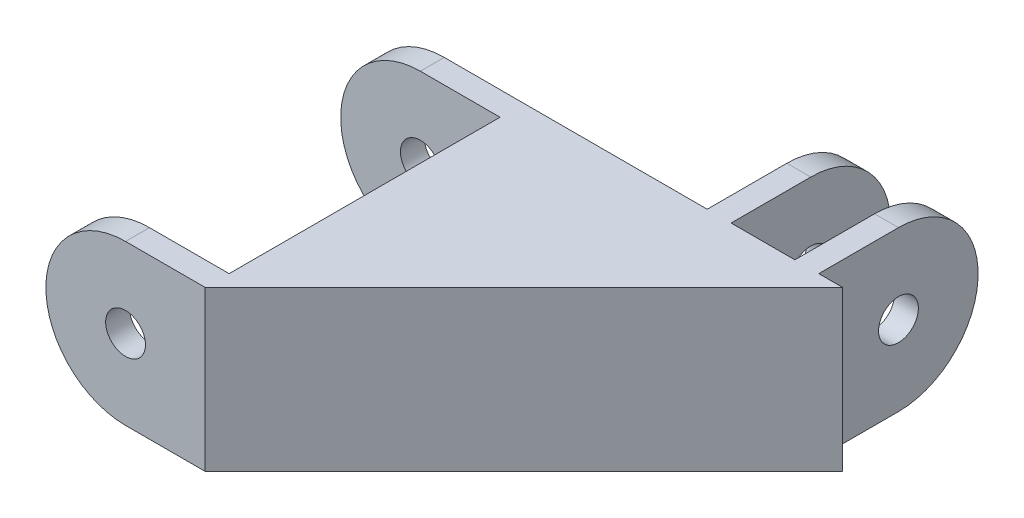
ISO-10303-21;
HEADER;
FILE_DESCRIPTION(('STEP AP214'),'2;1');
FILE_NAME('part.step','',(''),(''),'','','');
FILE_SCHEMA(('AUTOMOTIVE_DESIGN { 1 0 10303 214 1 1 1 1 }'));
ENDSEC;
DATA;
#1=APPLICATION_CONTEXT('core data for automotive mechanical design processes');
#2=APPLICATION_PROTOCOL_DEFINITION('international standard','automotive_design',2000,#1);
#3=PRODUCT_CONTEXT('',#1,'mechanical');
#4=PRODUCT('Part','Part','',(#3));
#5=PRODUCT_RELATED_PRODUCT_CATEGORY('part','',(#4));
#6=PRODUCT_DEFINITION_FORMATION('','',#4);
#7=PRODUCT_DEFINITION_CONTEXT('part definition',#1,'design');
#8=PRODUCT_DEFINITION('design','',#6,#7);
#9=PRODUCT_DEFINITION_SHAPE('','',#8);
#10=(LENGTH_UNIT() NAMED_UNIT(*) SI_UNIT(.MILLI.,.METRE.));
#11=(NAMED_UNIT(*) PLANE_ANGLE_UNIT() SI_UNIT($,.RADIAN.));
#12=(NAMED_UNIT(*) SI_UNIT($,.STERADIAN.) SOLID_ANGLE_UNIT());
#13=UNCERTAINTY_MEASURE_WITH_UNIT(LENGTH_MEASURE(1.E-05),#10,'distance_accuracy_value','');
#14=(GEOMETRIC_REPRESENTATION_CONTEXT(3) GLOBAL_UNCERTAINTY_ASSIGNED_CONTEXT((#13)) GLOBAL_UNIT_ASSIGNED_CONTEXT((#10,
#11,#12)) REPRESENTATION_CONTEXT('',''));
#15=CARTESIAN_POINT('',(0.,0.,0.));
#16=DIRECTION('',(0.,0.,1.));
#17=DIRECTION('',(1.,0.,0.));
#18=AXIS2_PLACEMENT_3D('',#15,#16,#17);
#19=CARTESIAN_POINT('',(0.,10.,-40.));
#20=DIRECTION('',(0.,0.,1.));
#21=DIRECTION('',(1.,0.,0.));
#22=AXIS2_PLACEMENT_3D('',#19,#20,#21);
#23=PLANE('',#22);
#24=DIRECTION('',(-1.,0.,0.));
#25=VECTOR('',#24,1.);
#26=CARTESIAN_POINT('',(0.,-8.,-40.));
#27=LINE('',#26,#25);
#28=CARTESIAN_POINT('',(34.,-8.,-40.));
#29=VERTEX_POINT('',#28);
#30=CARTESIAN_POINT('',(26.,-8.,-40.));
#31=VERTEX_POINT('',#30);
#32=EDGE_CURVE('E44',#29,#31,#27,.T.);
#33=ORIENTED_EDGE('',*,*,#32,.F.);
#34=DIRECTION('',(0.,-1.,0.));
#35=VECTOR('',#34,1.);
#36=CARTESIAN_POINT('',(34.,10.,-40.));
#37=LINE('',#36,#35);
#38=CARTESIAN_POINT('',(34.,-10.,-40.));
#39=VERTEX_POINT('',#38);
#40=EDGE_CURVE('E38',#29,#39,#37,.T.);
#41=ORIENTED_EDGE('',*,*,#40,.T.);
#42=DIRECTION('',(-1.,0.,0.));
#43=VECTOR('',#42,1.);
#44=CARTESIAN_POINT('',(0.,-10.,-40.));
#45=LINE('',#44,#43);
#46=CARTESIAN_POINT('',(26.,-10.,-40.));
#47=VERTEX_POINT('',#46);
#48=EDGE_CURVE('E393',#39,#47,#45,.T.);
#49=ORIENTED_EDGE('',*,*,#48,.T.);
#50=DIRECTION('',(0.,-1.,0.));
#51=VECTOR('',#50,1.);
#52=CARTESIAN_POINT('',(26.,10.,-40.));
#53=LINE('',#52,#51);
#54=EDGE_CURVE('E456',#31,#47,#53,.T.);
#55=ORIENTED_EDGE('',*,*,#54,.F.);
#56=EDGE_LOOP('',(#33,#41,#49,#55));
#57=FACE_BOUND('',#56,.T.);
#58=ADVANCED_FACE('F34',(#57),#23,.F.);
#59=CARTESIAN_POINT('',(0.,10.,0.));
#60=DIRECTION('',(1.,0.,0.));
#61=DIRECTION('',(0.,0.,-1.));
#62=AXIS2_PLACEMENT_3D('',#59,#60,#61);
#63=PLANE('',#62);
#64=DIRECTION('',(0.,0.,1.));
#65=VECTOR('',#64,1.);
#66=CARTESIAN_POINT('',(0.,-8.,0.));
#67=LINE('',#66,#65);
#68=CARTESIAN_POINT('',(0.,-8.,-37.));
#69=VERTEX_POINT('',#68);
#70=CARTESIAN_POINT('',(0.,-8.,-3.));
#71=VERTEX_POINT('',#70);
#72=EDGE_CURVE('E276',#69,#71,#67,.T.);
#73=ORIENTED_EDGE('',*,*,#72,.F.);
#74=DIRECTION('',(0.,1.,0.));
#75=VECTOR('',#74,1.);
#76=CARTESIAN_POINT('',(0.,10.,-37.));
#77=LINE('',#76,#75);
#78=CARTESIAN_POINT('',(0.,-10.,-37.));
#79=VERTEX_POINT('',#78);
#80=EDGE_CURVE('E296',#79,#69,#77,.T.);
#81=ORIENTED_EDGE('',*,*,#80,.F.);
#82=DIRECTION('',(0.,0.,1.));
#83=VECTOR('',#82,1.);
#84=CARTESIAN_POINT('',(0.,-10.,0.));
#85=LINE('',#84,#83);
#86=CARTESIAN_POINT('',(0.,-10.,-3.));
#87=VERTEX_POINT('',#86);
#88=EDGE_CURVE('E383',#79,#87,#85,.T.);
#89=ORIENTED_EDGE('',*,*,#88,.T.);
#90=DIRECTION('',(0.,1.,0.));
#91=VECTOR('',#90,1.);
#92=CARTESIAN_POINT('',(0.,10.,-3.));
#93=LINE('',#92,#91);
#94=EDGE_CURVE('E325',#87,#71,#93,.T.);
#95=ORIENTED_EDGE('',*,*,#94,.T.);
#96=EDGE_LOOP('',(#73,#81,#89,#95));
#97=FACE_BOUND('',#96,.T.);
#98=ADVANCED_FACE('F540',(#97),#63,.F.);
#99=CARTESIAN_POINT('',(34.,0.,-50.));
#100=DIRECTION('',(1.,0.,0.));
#101=DIRECTION('',(0.,0.,-1.));
#102=AXIS2_PLACEMENT_3D('',#99,#100,#101);
#103=PLANE('',#102);
#104=DIRECTION('',(0.,0.,-1.));
#105=VECTOR('',#104,1.);
#106=CARTESIAN_POINT('',(34.,-10.,-40.));
#107=LINE('',#106,#105);
#108=CARTESIAN_POINT('',(34.,-10.,-50.));
#109=VERTEX_POINT('',#108);
#110=EDGE_CURVE('E356',#39,#109,#107,.T.);
#111=ORIENTED_EDGE('',*,*,#110,.F.);
#112=ORIENTED_EDGE('',*,*,#40,.F.);
#113=CARTESIAN_POINT('',(34.,8.,-40.));
#114=VERTEX_POINT('',#113);
#115=EDGE_CURVE('E337',#114,#29,#37,.T.);
#116=ORIENTED_EDGE('',*,*,#115,.F.);
#117=CARTESIAN_POINT('',(34.,10.,-40.));
#118=VERTEX_POINT('',#117);
#119=EDGE_CURVE('E338',#118,#114,#37,.T.);
#120=ORIENTED_EDGE('',*,*,#119,.F.);
#121=DIRECTION('',(0.,0.,1.));
#122=VECTOR('',#121,1.);
#123=CARTESIAN_POINT('',(34.,10.,-40.));
#124=LINE('',#123,#122);
#125=CARTESIAN_POINT('',(34.,10.,-50.));
#126=VERTEX_POINT('',#125);
#127=EDGE_CURVE('E362',#126,#118,#124,.T.);
#128=ORIENTED_EDGE('',*,*,#127,.F.);
#129=CARTESIAN_POINT('',(34.,0.,-50.));
#130=DIRECTION('',(1.,0.,0.));
#131=DIRECTION('',(0.,0.,-1.));
#132=AXIS2_PLACEMENT_3D('',#129,#130,#131);
#133=CIRCLE('',#132,10.);
#134=EDGE_CURVE('E342',#109,#126,#133,.T.);
#135=ORIENTED_EDGE('',*,*,#134,.F.);
#136=EDGE_LOOP('',(#111,#112,#116,#120,#128,#135));
#137=FACE_BOUND('',#136,.T.);
#138=CARTESIAN_POINT('',(34.,0.,-50.));
#139=DIRECTION('',(1.,0.,0.));
#140=DIRECTION('',(0.,0.,-1.));
#141=AXIS2_PLACEMENT_3D('',#138,#139,#140);
#142=CIRCLE('',#141,2.5);
#143=CARTESIAN_POINT('',(34.,0.,-52.5));
#144=VERTEX_POINT('',#143);
#145=EDGE_CURVE('E430',#144,#144,#142,.F.);
#146=ORIENTED_EDGE('',*,*,#145,.F.);
#147=EDGE_LOOP('',(#146));
#148=FACE_BOUND('',#147,.T.);
#149=ADVANCED_FACE('F483',(#137,#148),#103,.F.);
#150=CARTESIAN_POINT('',(37.,0.,-50.));
#151=DIRECTION('',(1.,0.,0.));
#152=DIRECTION('',(0.,0.,-1.));
#153=AXIS2_PLACEMENT_3D('',#150,#151,#152);
#154=PLANE('',#153);
#155=DIRECTION('',(0.,0.,-1.));
#156=VECTOR('',#155,1.);
#157=CARTESIAN_POINT('',(37.,-10.,-40.));
#158=LINE('',#157,#156);
#159=CARTESIAN_POINT('',(37.,-10.,-40.));
#160=VERTEX_POINT('',#159);
#161=CARTESIAN_POINT('',(37.,-10.,-50.));
#162=VERTEX_POINT('',#161);
#163=EDGE_CURVE('E372',#160,#162,#158,.T.);
#164=ORIENTED_EDGE('',*,*,#163,.T.);
#165=CARTESIAN_POINT('',(37.,0.,-50.));
#166=DIRECTION('',(1.,0.,0.));
#167=DIRECTION('',(0.,0.,-1.));
#168=AXIS2_PLACEMENT_3D('',#165,#166,#167);
#169=CIRCLE('',#168,10.);
#170=CARTESIAN_POINT('',(37.,10.,-50.));
#171=VERTEX_POINT('',#170);
#172=EDGE_CURVE('E344',#162,#171,#169,.T.);
#173=ORIENTED_EDGE('',*,*,#172,.T.);
#174=DIRECTION('',(0.,0.,1.));
#175=VECTOR('',#174,1.);
#176=CARTESIAN_POINT('',(37.,10.,-40.));
#177=LINE('',#176,#175);
#178=CARTESIAN_POINT('',(37.,10.,-40.));
#179=VERTEX_POINT('',#178);
#180=EDGE_CURVE('E366',#171,#179,#177,.T.);
#181=ORIENTED_EDGE('',*,*,#180,.T.);
#182=DIRECTION('',(0.,-1.,0.));
#183=VECTOR('',#182,1.);
#184=CARTESIAN_POINT('',(37.,10.,-40.));
#185=LINE('',#184,#183);
#186=EDGE_CURVE('E359',#179,#160,#185,.T.);
#187=ORIENTED_EDGE('',*,*,#186,.T.);
#188=EDGE_LOOP('',(#164,#173,#181,#187));
#189=FACE_BOUND('',#188,.T.);
#190=CARTESIAN_POINT('',(37.,0.,-50.));
#191=DIRECTION('',(1.,0.,0.));
#192=DIRECTION('',(0.,0.,-1.));
#193=AXIS2_PLACEMENT_3D('',#190,#191,#192);
#194=CIRCLE('',#193,2.5);
#195=CARTESIAN_POINT('',(37.,0.,-52.5));
#196=VERTEX_POINT('',#195);
#197=EDGE_CURVE('E415',#196,#196,#194,.F.);
#198=ORIENTED_EDGE('',*,*,#197,.T.);
#199=EDGE_LOOP('',(#198));
#200=FACE_BOUND('',#199,.T.);
#201=ADVANCED_FACE('F495',(#189,#200),#154,.T.);
#202=CARTESIAN_POINT('',(23.,0.,-50.));
#203=DIRECTION('',(1.,0.,0.));
#204=DIRECTION('',(0.,0.,-1.));
#205=AXIS2_PLACEMENT_3D('',#202,#203,#204);
#206=PLANE('',#205);
#207=DIRECTION('',(0.,0.,-1.));
#208=VECTOR('',#207,1.);
#209=CARTESIAN_POINT('',(23.,-10.,-40.));
#210=LINE('',#209,#208);
#211=CARTESIAN_POINT('',(23.,-10.,-40.));
#212=VERTEX_POINT('',#211);
#213=CARTESIAN_POINT('',(23.,-10.,-50.));
#214=VERTEX_POINT('',#213);
#215=EDGE_CURVE('E434',#212,#214,#210,.T.);
#216=ORIENTED_EDGE('',*,*,#215,.F.);
#217=DIRECTION('',(0.,-1.,0.));
#218=VECTOR('',#217,1.);
#219=CARTESIAN_POINT('',(23.,10.,-40.));
#220=LINE('',#219,#218);
#221=CARTESIAN_POINT('',(23.,10.,-40.));
#222=VERTEX_POINT('',#221);
#223=EDGE_CURVE('E444',#222,#212,#220,.T.);
#224=ORIENTED_EDGE('',*,*,#223,.F.);
#225=DIRECTION('',(0.,0.,1.));
#226=VECTOR('',#225,1.);
#227=CARTESIAN_POINT('',(23.,10.,-40.));
#228=LINE('',#227,#226);
#229=CARTESIAN_POINT('',(23.,10.,-50.));
#230=VERTEX_POINT('',#229);
#231=EDGE_CURVE('E441',#230,#222,#228,.T.);
#232=ORIENTED_EDGE('',*,*,#231,.F.);
#233=CARTESIAN_POINT('',(23.,0.,-50.));
#234=DIRECTION('',(1.,0.,0.));
#235=DIRECTION('',(0.,0.,-1.));
#236=AXIS2_PLACEMENT_3D('',#233,#234,#235);
#237=CIRCLE('',#236,10.);
#238=EDGE_CURVE('E437',#214,#230,#237,.T.);
#239=ORIENTED_EDGE('',*,*,#238,.F.);
#240=EDGE_LOOP('',(#216,#224,#232,#239));
#241=FACE_BOUND('',#240,.T.);
#242=CARTESIAN_POINT('',(23.,0.,-50.));
#243=DIRECTION('',(1.,0.,0.));
#244=DIRECTION('',(0.,0.,-1.));
#245=AXIS2_PLACEMENT_3D('',#242,#243,#244);
#246=CIRCLE('',#245,2.5);
#247=CARTESIAN_POINT('',(23.,0.,-52.5));
#248=VERTEX_POINT('',#247);
#249=EDGE_CURVE('E410',#248,#248,#246,.F.);
#250=ORIENTED_EDGE('',*,*,#249,.F.);
#251=EDGE_LOOP('',(#250));
#252=FACE_BOUND('',#251,.T.);
#253=ADVANCED_FACE('F696',(#241,#252),#206,.F.);
#254=CARTESIAN_POINT('',(26.,0.,-50.));
#255=DIRECTION('',(1.,0.,0.));
#256=DIRECTION('',(0.,0.,-1.));
#257=AXIS2_PLACEMENT_3D('',#254,#255,#256);
#258=PLANE('',#257);
#259=DIRECTION('',(0.,0.,-1.));
#260=VECTOR('',#259,1.);
#261=CARTESIAN_POINT('',(26.,-10.,-40.));
#262=LINE('',#261,#260);
#263=CARTESIAN_POINT('',(26.,-10.,-50.));
#264=VERTEX_POINT('',#263);
#265=EDGE_CURVE('E433',#47,#264,#262,.T.);
#266=ORIENTED_EDGE('',*,*,#265,.T.);
#267=CARTESIAN_POINT('',(26.,0.,-50.));
#268=DIRECTION('',(1.,0.,0.));
#269=DIRECTION('',(0.,0.,-1.));
#270=AXIS2_PLACEMENT_3D('',#267,#268,#269);
#271=CIRCLE('',#270,10.);
#272=CARTESIAN_POINT('',(26.,10.,-50.));
#273=VERTEX_POINT('',#272);
#274=EDGE_CURVE('E450',#264,#273,#271,.T.);
#275=ORIENTED_EDGE('',*,*,#274,.T.);
#276=DIRECTION('',(0.,0.,1.));
#277=VECTOR('',#276,1.);
#278=CARTESIAN_POINT('',(26.,10.,-40.));
#279=LINE('',#278,#277);
#280=CARTESIAN_POINT('',(26.,10.,-40.));
#281=VERTEX_POINT('',#280);
#282=EDGE_CURVE('E453',#273,#281,#279,.T.);
#283=ORIENTED_EDGE('',*,*,#282,.T.);
#284=CARTESIAN_POINT('',(26.,8.,-40.));
#285=VERTEX_POINT('',#284);
#286=EDGE_CURVE('E438',#281,#285,#53,.T.);
#287=ORIENTED_EDGE('',*,*,#286,.T.);
#288=EDGE_CURVE('E459',#285,#31,#53,.T.);
#289=ORIENTED_EDGE('',*,*,#288,.T.);
#290=ORIENTED_EDGE('',*,*,#54,.T.);
#291=EDGE_LOOP('',(#266,#275,#283,#287,#289,#290));
#292=FACE_BOUND('',#291,.T.);
#293=CARTESIAN_POINT('',(26.,0.,-50.));
#294=DIRECTION('',(1.,0.,0.));
#295=DIRECTION('',(0.,0.,-1.));
#296=AXIS2_PLACEMENT_3D('',#293,#294,#295);
#297=CIRCLE('',#296,2.5);
#298=CARTESIAN_POINT('',(26.,0.,-52.5));
#299=VERTEX_POINT('',#298);
#300=EDGE_CURVE('E408',#299,#299,#297,.F.);
#301=ORIENTED_EDGE('',*,*,#300,.T.);
#302=EDGE_LOOP('',(#301));
#303=FACE_BOUND('',#302,.T.);
#304=ADVANCED_FACE('F473',(#292,#303),#258,.T.);
#305=ORIENTED_EDGE('',*,*,#223,.T.);
#306=CARTESIAN_POINT('',(-10.,-10.,-40.));
#307=VERTEX_POINT('',#306);
#308=EDGE_CURVE('E398',#212,#307,#45,.T.);
#309=ORIENTED_EDGE('',*,*,#308,.T.);
#310=CARTESIAN_POINT('',(-10.,0.,-40.));
#311=DIRECTION('',(0.,0.,1.));
#312=DIRECTION('',(1.,0.,0.));
#313=AXIS2_PLACEMENT_3D('',#310,#311,#312);
#314=CIRCLE('',#313,10.);
#315=CARTESIAN_POINT('',(-10.,10.,-40.));
#316=VERTEX_POINT('',#315);
#317=EDGE_CURVE('E291',#316,#307,#314,.T.);
#318=ORIENTED_EDGE('',*,*,#317,.F.);
#319=DIRECTION('',(-1.,0.,0.));
#320=VECTOR('',#319,1.);
#321=CARTESIAN_POINT('',(0.,10.,-40.));
#322=LINE('',#321,#320);
#323=EDGE_CURVE('E382',#222,#316,#322,.T.);
#324=ORIENTED_EDGE('',*,*,#323,.F.);
#325=EDGE_LOOP('',(#305,#309,#318,#324));
#326=FACE_BOUND('',#325,.T.);
#327=CARTESIAN_POINT('',(-10.,0.,-40.));
#328=DIRECTION('',(0.,0.,1.));
#329=DIRECTION('',(1.,0.,0.));
#330=AXIS2_PLACEMENT_3D('',#327,#328,#329);
#331=CIRCLE('',#330,2.5);
#332=CARTESIAN_POINT('',(-7.5,0.,-40.));
#333=VERTEX_POINT('',#332);
#334=EDGE_CURVE('E285',#333,#333,#331,.T.);
#335=ORIENTED_EDGE('',*,*,#334,.T.);
#336=EDGE_LOOP('',(#335));
#337=FACE_BOUND('',#336,.T.);
#338=ADVANCED_FACE('F561',(#326,#337),#23,.F.);
#339=ORIENTED_EDGE('',*,*,#186,.F.);
#340=CARTESIAN_POINT('',(40.,10.,-40.));
#341=VERTEX_POINT('',#340);
#342=EDGE_CURVE('E390',#341,#179,#322,.T.);
#343=ORIENTED_EDGE('',*,*,#342,.F.);
#344=DIRECTION('',(0.,-1.,0.));
#345=VECTOR('',#344,1.);
#346=CARTESIAN_POINT('',(40.,10.,-40.));
#347=LINE('',#346,#345);
#348=CARTESIAN_POINT('',(40.,-10.,-40.));
#349=VERTEX_POINT('',#348);
#350=EDGE_CURVE('E504',#341,#349,#347,.T.);
#351=ORIENTED_EDGE('',*,*,#350,.T.);
#352=EDGE_CURVE('E397',#349,#160,#45,.T.);
#353=ORIENTED_EDGE('',*,*,#352,.T.);
#354=EDGE_LOOP('',(#339,#343,#351,#353));
#355=FACE_BOUND('',#354,.T.);
#356=ADVANCED_FACE('F505',(#355),#23,.F.);
#357=CARTESIAN_POINT('',(40.,10.,-40.));
#358=DIRECTION('',(-0.707106781186548,0.,-0.707106781186548));
#359=DIRECTION('',(-0.707106781186548,0.,0.707106781186548));
#360=AXIS2_PLACEMENT_3D('',#357,#358,#359);
#361=PLANE('',#360);
#362=DIRECTION('',(0.707106781186548,0.,-0.707106781186548));
#363=VECTOR('',#362,1.);
#364=CARTESIAN_POINT('',(40.,-10.,-40.));
#365=LINE('',#364,#363);
#366=CARTESIAN_POINT('',(0.,-10.,0.));
#367=VERTEX_POINT('',#366);
#368=EDGE_CURVE('E378',#367,#349,#365,.T.);
#369=ORIENTED_EDGE('',*,*,#368,.T.);
#370=ORIENTED_EDGE('',*,*,#350,.F.);
#371=DIRECTION('',(0.707106781186548,0.,-0.707106781186548));
#372=VECTOR('',#371,1.);
#373=CARTESIAN_POINT('',(40.,10.,-40.));
#374=LINE('',#373,#372);
#375=CARTESIAN_POINT('',(0.,10.,0.));
#376=VERTEX_POINT('',#375);
#377=EDGE_CURVE('E380',#376,#341,#374,.T.);
#378=ORIENTED_EDGE('',*,*,#377,.F.);
#379=DIRECTION('',(0.,-1.,0.));
#380=VECTOR('',#379,1.);
#381=CARTESIAN_POINT('',(0.,10.,0.));
#382=LINE('',#381,#380);
#383=EDGE_CURVE('E508',#376,#367,#382,.T.);
#384=ORIENTED_EDGE('',*,*,#383,.T.);
#385=EDGE_LOOP('',(#369,#370,#378,#384));
#386=FACE_BOUND('',#385,.T.);
#387=ADVANCED_FACE('F36',(#386),#361,.F.);
#388=ORIENTED_EDGE('',*,*,#119,.T.);
#389=DIRECTION('',(-1.,0.,0.));
#390=VECTOR('',#389,1.);
#391=CARTESIAN_POINT('',(0.,8.,-40.));
#392=LINE('',#391,#390);
#393=EDGE_CURVE('E11',#114,#285,#392,.T.);
#394=ORIENTED_EDGE('',*,*,#393,.T.);
#395=ORIENTED_EDGE('',*,*,#286,.F.);
#396=EDGE_CURVE('E353',#118,#281,#322,.T.);
#397=ORIENTED_EDGE('',*,*,#396,.F.);
#398=EDGE_LOOP('',(#388,#394,#395,#397));
#399=FACE_BOUND('',#398,.T.);
#400=ADVANCED_FACE('F562',(#399),#23,.F.);
#401=CARTESIAN_POINT('',(0.,8.,-37.));
#402=VERTEX_POINT('',#401);
#403=CARTESIAN_POINT('',(0.,10.,-37.));
#404=VERTEX_POINT('',#403);
#405=EDGE_CURVE('E288',#402,#404,#77,.T.);
#406=ORIENTED_EDGE('',*,*,#405,.F.);
#407=DIRECTION('',(0.,0.,1.));
#408=VECTOR('',#407,1.);
#409=CARTESIAN_POINT('',(0.,8.,0.));
#410=LINE('',#409,#408);
#411=CARTESIAN_POINT('',(0.,8.,-3.));
#412=VERTEX_POINT('',#411);
#413=EDGE_CURVE('E252',#402,#412,#410,.T.);
#414=ORIENTED_EDGE('',*,*,#413,.T.);
#415=CARTESIAN_POINT('',(0.,10.,-3.));
#416=VERTEX_POINT('',#415);
#417=EDGE_CURVE('E332',#412,#416,#93,.T.);
#418=ORIENTED_EDGE('',*,*,#417,.T.);
#419=DIRECTION('',(0.,0.,1.));
#420=VECTOR('',#419,1.);
#421=CARTESIAN_POINT('',(0.,10.,0.));
#422=LINE('',#421,#420);
#423=EDGE_CURVE('E333',#404,#416,#422,.T.);
#424=ORIENTED_EDGE('',*,*,#423,.F.);
#425=EDGE_LOOP('',(#406,#414,#418,#424));
#426=FACE_BOUND('',#425,.T.);
#427=ADVANCED_FACE('F567',(#426),#63,.F.);
#428=CARTESIAN_POINT('',(0.,10.,0.));
#429=DIRECTION('',(0.,-1.,0.));
#430=DIRECTION('',(0.,0.,-1.));
#431=AXIS2_PLACEMENT_3D('',#428,#429,#430);
#432=PLANE('',#431);
#433=ORIENTED_EDGE('',*,*,#377,.T.);
#434=ORIENTED_EDGE('',*,*,#342,.T.);
#435=ORIENTED_EDGE('',*,*,#180,.F.);
#436=DIRECTION('',(1.,0.,0.));
#437=VECTOR('',#436,1.);
#438=CARTESIAN_POINT('',(34.,10.,-50.));
#439=LINE('',#438,#437);
#440=EDGE_CURVE('E376',#126,#171,#439,.T.);
#441=ORIENTED_EDGE('',*,*,#440,.F.);
#442=ORIENTED_EDGE('',*,*,#127,.T.);
#443=ORIENTED_EDGE('',*,*,#396,.T.);
#444=ORIENTED_EDGE('',*,*,#282,.F.);
#445=DIRECTION('',(1.,0.,0.));
#446=VECTOR('',#445,1.);
#447=CARTESIAN_POINT('',(23.,10.,-50.));
#448=LINE('',#447,#446);
#449=EDGE_CURVE('E460',#230,#273,#448,.T.);
#450=ORIENTED_EDGE('',*,*,#449,.F.);
#451=ORIENTED_EDGE('',*,*,#231,.T.);
#452=ORIENTED_EDGE('',*,*,#323,.T.);
#453=DIRECTION('',(0.,0.,1.));
#454=VECTOR('',#453,1.);
#455=CARTESIAN_POINT('',(-10.,10.,-40.));
#456=LINE('',#455,#454);
#457=CARTESIAN_POINT('',(-10.,10.,-37.));
#458=VERTEX_POINT('',#457);
#459=EDGE_CURVE('E294',#316,#458,#456,.T.);
#460=ORIENTED_EDGE('',*,*,#459,.T.);
#461=DIRECTION('',(-1.,0.,0.));
#462=VECTOR('',#461,1.);
#463=CARTESIAN_POINT('',(0.,10.,-37.));
#464=LINE('',#463,#462);
#465=EDGE_CURVE('E299',#404,#458,#464,.T.);
#466=ORIENTED_EDGE('',*,*,#465,.F.);
#467=ORIENTED_EDGE('',*,*,#423,.T.);
#468=DIRECTION('',(-1.,0.,0.));
#469=VECTOR('',#468,1.);
#470=CARTESIAN_POINT('',(0.,10.,-3.));
#471=LINE('',#470,#469);
#472=CARTESIAN_POINT('',(-10.,10.,-3.));
#473=VERTEX_POINT('',#472);
#474=EDGE_CURVE('E520',#416,#473,#471,.T.);
#475=ORIENTED_EDGE('',*,*,#474,.T.);
#476=DIRECTION('',(0.,0.,1.));
#477=VECTOR('',#476,1.);
#478=CARTESIAN_POINT('',(-10.,10.,-3.));
#479=LINE('',#478,#477);
#480=CARTESIAN_POINT('',(-10.,10.,0.));
#481=VERTEX_POINT('',#480);
#482=EDGE_CURVE('E417',#473,#481,#479,.T.);
#483=ORIENTED_EDGE('',*,*,#482,.T.);
#484=DIRECTION('',(-1.,0.,0.));
#485=VECTOR('',#484,1.);
#486=CARTESIAN_POINT('',(0.,10.,0.));
#487=LINE('',#486,#485);
#488=EDGE_CURVE('E315',#376,#481,#487,.T.);
#489=ORIENTED_EDGE('',*,*,#488,.F.);
#490=EDGE_LOOP('',(#433,#434,#435,#441,#442,#443,#444,#450,#451,#452,#460,#466,#467,#475,#483,#489));
#491=FACE_BOUND('',#490,.T.);
#492=ADVANCED_FACE('F519',(#491),#432,.F.);
#493=CARTESIAN_POINT('',(0.,-10.,0.));
#494=DIRECTION('',(0.,-1.,0.));
#495=DIRECTION('',(0.,0.,-1.));
#496=AXIS2_PLACEMENT_3D('',#493,#494,#495);
#497=PLANE('',#496);
#498=ORIENTED_EDGE('',*,*,#368,.F.);
#499=DIRECTION('',(1.,0.,0.));
#500=VECTOR('',#499,1.);
#501=CARTESIAN_POINT('',(0.,-10.,0.));
#502=LINE('',#501,#500);
#503=CARTESIAN_POINT('',(-10.,-10.,0.));
#504=VERTEX_POINT('',#503);
#505=EDGE_CURVE('E336',#504,#367,#502,.T.);
#506=ORIENTED_EDGE('',*,*,#505,.F.);
#507=DIRECTION('',(0.,0.,1.));
#508=VECTOR('',#507,1.);
#509=CARTESIAN_POINT('',(-10.,-10.,-3.));
#510=LINE('',#509,#508);
#511=CARTESIAN_POINT('',(-10.,-10.,-3.));
#512=VERTEX_POINT('',#511);
#513=EDGE_CURVE('E411',#512,#504,#510,.T.);
#514=ORIENTED_EDGE('',*,*,#513,.F.);
#515=DIRECTION('',(1.,0.,0.));
#516=VECTOR('',#515,1.);
#517=CARTESIAN_POINT('',(0.,-10.,-3.));
#518=LINE('',#517,#516);
#519=EDGE_CURVE('E423',#512,#87,#518,.T.);
#520=ORIENTED_EDGE('',*,*,#519,.T.);
#521=ORIENTED_EDGE('',*,*,#88,.F.);
#522=DIRECTION('',(1.,0.,0.));
#523=VECTOR('',#522,1.);
#524=CARTESIAN_POINT('',(0.,-10.,-37.));
#525=LINE('',#524,#523);
#526=CARTESIAN_POINT('',(-10.,-10.,-37.));
#527=VERTEX_POINT('',#526);
#528=EDGE_CURVE('E295',#527,#79,#525,.T.);
#529=ORIENTED_EDGE('',*,*,#528,.F.);
#530=DIRECTION('',(0.,0.,1.));
#531=VECTOR('',#530,1.);
#532=CARTESIAN_POINT('',(-10.,-10.,-40.));
#533=LINE('',#532,#531);
#534=EDGE_CURVE('E308',#307,#527,#533,.T.);
#535=ORIENTED_EDGE('',*,*,#534,.F.);
#536=ORIENTED_EDGE('',*,*,#308,.F.);
#537=ORIENTED_EDGE('',*,*,#215,.T.);
#538=DIRECTION('',(1.,0.,0.));
#539=VECTOR('',#538,1.);
#540=CARTESIAN_POINT('',(23.,-10.,-50.));
#541=LINE('',#540,#539);
#542=EDGE_CURVE('E447',#214,#264,#541,.T.);
#543=ORIENTED_EDGE('',*,*,#542,.T.);
#544=ORIENTED_EDGE('',*,*,#265,.F.);
#545=ORIENTED_EDGE('',*,*,#48,.F.);
#546=ORIENTED_EDGE('',*,*,#110,.T.);
#547=DIRECTION('',(1.,0.,0.));
#548=VECTOR('',#547,1.);
#549=CARTESIAN_POINT('',(34.,-10.,-50.));
#550=LINE('',#549,#548);
#551=EDGE_CURVE('E352',#109,#162,#550,.T.);
#552=ORIENTED_EDGE('',*,*,#551,.T.);
#553=ORIENTED_EDGE('',*,*,#163,.F.);
#554=ORIENTED_EDGE('',*,*,#352,.F.);
#555=EDGE_LOOP('',(#498,#506,#514,#520,#521,#529,#535,#536,#537,#543,#544,#545,#546,#552,#553,#554));
#556=FACE_BOUND('',#555,.T.);
#557=ADVANCED_FACE('F465',(#556),#497,.T.);
#558=CARTESIAN_POINT('',(34.,0.,-50.));
#559=DIRECTION('',(1.,0.,0.));
#560=DIRECTION('',(0.,0.,-1.));
#561=AXIS2_PLACEMENT_3D('',#558,#559,#560);
#562=CYLINDRICAL_SURFACE('',#561,10.);
#563=ORIENTED_EDGE('',*,*,#172,.F.);
#564=ORIENTED_EDGE('',*,*,#551,.F.);
#565=ORIENTED_EDGE('',*,*,#134,.T.);
#566=ORIENTED_EDGE('',*,*,#440,.T.);
#567=EDGE_LOOP('',(#563,#564,#565,#566));
#568=FACE_BOUND('',#567,.T.);
#569=ADVANCED_FACE('F490',(#568),#562,.T.);
#570=CARTESIAN_POINT('',(23.,0.,-50.));
#571=DIRECTION('',(1.,0.,0.));
#572=DIRECTION('',(0.,0.,-1.));
#573=AXIS2_PLACEMENT_3D('',#570,#571,#572);
#574=CYLINDRICAL_SURFACE('',#573,10.);
#575=ORIENTED_EDGE('',*,*,#274,.F.);
#576=ORIENTED_EDGE('',*,*,#542,.F.);
#577=ORIENTED_EDGE('',*,*,#238,.T.);
#578=ORIENTED_EDGE('',*,*,#449,.T.);
#579=EDGE_LOOP('',(#575,#576,#577,#578));
#580=FACE_BOUND('',#579,.T.);
#581=ADVANCED_FACE('F470',(#580),#574,.T.);
#582=CARTESIAN_POINT('',(40.,0.,-50.));
#583=DIRECTION('',(-1.,0.,0.));
#584=DIRECTION('',(0.,0.,1.));
#585=AXIS2_PLACEMENT_3D('',#582,#583,#584);
#586=CYLINDRICAL_SURFACE('',#585,2.5);
#587=ORIENTED_EDGE('',*,*,#300,.F.);
#588=EDGE_LOOP('',(#587));
#589=FACE_BOUND('',#588,.T.);
#590=ORIENTED_EDGE('',*,*,#249,.T.);
#591=EDGE_LOOP('',(#590));
#592=FACE_BOUND('',#591,.T.);
#593=ADVANCED_FACE('F873',(#589,#592),#586,.F.);
#594=ORIENTED_EDGE('',*,*,#197,.F.);
#595=EDGE_LOOP('',(#594));
#596=FACE_BOUND('',#595,.T.);
#597=ORIENTED_EDGE('',*,*,#145,.T.);
#598=EDGE_LOOP('',(#597));
#599=FACE_BOUND('',#598,.T.);
#600=ADVANCED_FACE('F595',(#596,#599),#586,.F.);
#601=CARTESIAN_POINT('',(-10.,0.,-3.));
#602=DIRECTION('',(0.,0.,1.));
#603=DIRECTION('',(1.,0.,0.));
#604=AXIS2_PLACEMENT_3D('',#601,#602,#603);
#605=CYLINDRICAL_SURFACE('',#604,10.);
#606=CARTESIAN_POINT('',(-10.,0.,0.));
#607=DIRECTION('',(0.,0.,1.));
#608=DIRECTION('',(1.,0.,0.));
#609=AXIS2_PLACEMENT_3D('',#606,#607,#608);
#610=CIRCLE('',#609,10.);
#611=EDGE_CURVE('E543',#481,#504,#610,.T.);
#612=ORIENTED_EDGE('',*,*,#611,.F.);
#613=ORIENTED_EDGE('',*,*,#482,.F.);
#614=CARTESIAN_POINT('',(-10.,0.,-3.));
#615=DIRECTION('',(0.,0.,1.));
#616=DIRECTION('',(1.,0.,0.));
#617=AXIS2_PLACEMENT_3D('',#614,#615,#616);
#618=CIRCLE('',#617,10.);
#619=EDGE_CURVE('E320',#473,#512,#618,.T.);
#620=ORIENTED_EDGE('',*,*,#619,.T.);
#621=ORIENTED_EDGE('',*,*,#513,.T.);
#622=EDGE_LOOP('',(#612,#613,#620,#621));
#623=FACE_BOUND('',#622,.T.);
#624=ADVANCED_FACE('F542',(#623),#605,.T.);
#625=CARTESIAN_POINT('',(-10.,0.,-3.));
#626=DIRECTION('',(0.,0.,1.));
#627=DIRECTION('',(1.,0.,0.));
#628=AXIS2_PLACEMENT_3D('',#625,#626,#627);
#629=PLANE('',#628);
#630=CARTESIAN_POINT('',(-10.,0.,-3.));
#631=DIRECTION('',(0.,0.,1.));
#632=DIRECTION('',(1.,0.,0.));
#633=AXIS2_PLACEMENT_3D('',#630,#631,#632);
#634=CIRCLE('',#633,2.5);
#635=CARTESIAN_POINT('',(-7.5,0.,-3.));
#636=VERTEX_POINT('',#635);
#637=EDGE_CURVE('E312',#636,#636,#634,.T.);
#638=ORIENTED_EDGE('',*,*,#637,.T.);
#639=EDGE_LOOP('',(#638));
#640=FACE_BOUND('',#639,.T.);
#641=ORIENTED_EDGE('',*,*,#94,.F.);
#642=ORIENTED_EDGE('',*,*,#519,.F.);
#643=ORIENTED_EDGE('',*,*,#619,.F.);
#644=ORIENTED_EDGE('',*,*,#474,.F.);
#645=ORIENTED_EDGE('',*,*,#417,.F.);
#646=EDGE_CURVE('E330',#71,#412,#93,.T.);
#647=ORIENTED_EDGE('',*,*,#646,.F.);
#648=EDGE_LOOP('',(#641,#642,#643,#644,#645,#647));
#649=FACE_BOUND('',#648,.T.);
#650=ADVANCED_FACE('F527',(#640,#649),#629,.F.);
#651=CARTESIAN_POINT('',(-10.,0.,0.));
#652=DIRECTION('',(0.,0.,1.));
#653=DIRECTION('',(1.,0.,0.));
#654=AXIS2_PLACEMENT_3D('',#651,#652,#653);
#655=PLANE('',#654);
#656=CARTESIAN_POINT('',(-10.,0.,0.));
#657=DIRECTION('',(0.,0.,1.));
#658=DIRECTION('',(1.,0.,0.));
#659=AXIS2_PLACEMENT_3D('',#656,#657,#658);
#660=CIRCLE('',#659,2.5);
#661=CARTESIAN_POINT('',(-7.5,0.,0.));
#662=VERTEX_POINT('',#661);
#663=EDGE_CURVE('E310',#662,#662,#660,.T.);
#664=ORIENTED_EDGE('',*,*,#663,.F.);
#665=EDGE_LOOP('',(#664));
#666=FACE_BOUND('',#665,.T.);
#667=ORIENTED_EDGE('',*,*,#383,.F.);
#668=ORIENTED_EDGE('',*,*,#488,.T.);
#669=ORIENTED_EDGE('',*,*,#611,.T.);
#670=ORIENTED_EDGE('',*,*,#505,.T.);
#671=EDGE_LOOP('',(#667,#668,#669,#670));
#672=FACE_BOUND('',#671,.T.);
#673=ADVANCED_FACE('F544',(#666,#672),#655,.T.);
#674=CARTESIAN_POINT('',(-10.,0.,-3.));
#675=DIRECTION('',(0.,0.,1.));
#676=DIRECTION('',(1.,0.,0.));
#677=AXIS2_PLACEMENT_3D('',#674,#675,#676);
#678=CYLINDRICAL_SURFACE('',#677,2.5);
#679=ORIENTED_EDGE('',*,*,#637,.F.);
#680=EDGE_LOOP('',(#679));
#681=FACE_BOUND('',#680,.T.);
#682=ORIENTED_EDGE('',*,*,#663,.T.);
#683=EDGE_LOOP('',(#682));
#684=FACE_BOUND('',#683,.T.);
#685=ADVANCED_FACE('F546',(#681,#684),#678,.F.);
#686=CARTESIAN_POINT('',(-10.,0.,-40.));
#687=DIRECTION('',(0.,0.,1.));
#688=DIRECTION('',(1.,0.,0.));
#689=AXIS2_PLACEMENT_3D('',#686,#687,#688);
#690=CYLINDRICAL_SURFACE('',#689,10.);
#691=CARTESIAN_POINT('',(-10.,0.,-37.));
#692=DIRECTION('',(0.,0.,1.));
#693=DIRECTION('',(1.,0.,0.));
#694=AXIS2_PLACEMENT_3D('',#691,#692,#693);
#695=CIRCLE('',#694,10.);
#696=EDGE_CURVE('E303',#458,#527,#695,.T.);
#697=ORIENTED_EDGE('',*,*,#696,.F.);
#698=ORIENTED_EDGE('',*,*,#459,.F.);
#699=ORIENTED_EDGE('',*,*,#317,.T.);
#700=ORIENTED_EDGE('',*,*,#534,.T.);
#701=EDGE_LOOP('',(#697,#698,#699,#700));
#702=FACE_BOUND('',#701,.T.);
#703=ADVANCED_FACE('F553',(#702),#690,.T.);
#704=CARTESIAN_POINT('',(-10.,0.,-37.));
#705=DIRECTION('',(0.,0.,1.));
#706=DIRECTION('',(1.,0.,0.));
#707=AXIS2_PLACEMENT_3D('',#704,#705,#706);
#708=PLANE('',#707);
#709=CARTESIAN_POINT('',(-10.,0.,-37.));
#710=DIRECTION('',(0.,0.,1.));
#711=DIRECTION('',(1.,0.,0.));
#712=AXIS2_PLACEMENT_3D('',#709,#710,#711);
#713=CIRCLE('',#712,2.5);
#714=CARTESIAN_POINT('',(-7.5,0.,-37.));
#715=VERTEX_POINT('',#714);
#716=EDGE_CURVE('E284',#715,#715,#713,.T.);
#717=ORIENTED_EDGE('',*,*,#716,.F.);
#718=EDGE_LOOP('',(#717));
#719=FACE_BOUND('',#718,.T.);
#720=ORIENTED_EDGE('',*,*,#80,.T.);
#721=EDGE_CURVE('E300',#69,#402,#77,.T.);
#722=ORIENTED_EDGE('',*,*,#721,.T.);
#723=ORIENTED_EDGE('',*,*,#405,.T.);
#724=ORIENTED_EDGE('',*,*,#465,.T.);
#725=ORIENTED_EDGE('',*,*,#696,.T.);
#726=ORIENTED_EDGE('',*,*,#528,.T.);
#727=EDGE_LOOP('',(#720,#722,#723,#724,#725,#726));
#728=FACE_BOUND('',#727,.T.);
#729=ADVANCED_FACE('F653',(#719,#728),#708,.T.);
#730=CARTESIAN_POINT('',(-10.,0.,-40.));
#731=DIRECTION('',(0.,0.,1.));
#732=DIRECTION('',(1.,0.,0.));
#733=AXIS2_PLACEMENT_3D('',#730,#731,#732);
#734=CYLINDRICAL_SURFACE('',#733,2.5);
#735=ORIENTED_EDGE('',*,*,#334,.F.);
#736=EDGE_LOOP('',(#735));
#737=FACE_BOUND('',#736,.T.);
#738=ORIENTED_EDGE('',*,*,#716,.T.);
#739=EDGE_LOOP('',(#738));
#740=FACE_BOUND('',#739,.T.);
#741=ADVANCED_FACE('F661',(#737,#740),#734,.F.);
#742=CARTESIAN_POINT('',(0.,10.,-40.));
#743=DIRECTION('',(0.,0.,1.));
#744=DIRECTION('',(1.,0.,0.));
#745=AXIS2_PLACEMENT_3D('',#742,#743,#744);
#746=PLANE('',#745);
#747=ORIENTED_EDGE('',*,*,#115,.T.);
#748=CARTESIAN_POINT('',(35.,-8.,-40.));
#749=VERTEX_POINT('',#748);
#750=EDGE_CURVE('E54',#749,#29,#27,.T.);
#751=ORIENTED_EDGE('',*,*,#750,.F.);
#752=DIRECTION('',(0.,-1.,0.));
#753=VECTOR('',#752,1.);
#754=CARTESIAN_POINT('',(35.,0.,-40.));
#755=LINE('',#754,#753);
#756=CARTESIAN_POINT('',(35.,8.,-40.));
#757=VERTEX_POINT('',#756);
#758=EDGE_CURVE('E282',#757,#749,#755,.T.);
#759=ORIENTED_EDGE('',*,*,#758,.F.);
#760=EDGE_CURVE('E46',#757,#114,#392,.T.);
#761=ORIENTED_EDGE('',*,*,#760,.T.);
#762=EDGE_LOOP('',(#747,#751,#759,#761));
#763=FACE_BOUND('',#762,.T.);
#764=ADVANCED_FACE('F665',(#763),#746,.T.);
#765=CARTESIAN_POINT('',(0.,10.,0.));
#766=DIRECTION('',(1.,0.,0.));
#767=DIRECTION('',(0.,0.,-1.));
#768=AXIS2_PLACEMENT_3D('',#765,#766,#767);
#769=PLANE('',#768);
#770=ORIENTED_EDGE('',*,*,#646,.T.);
#771=CARTESIAN_POINT('',(0.,8.,-2.8284271247462));
#772=VERTEX_POINT('',#771);
#773=EDGE_CURVE('E62',#412,#772,#410,.T.);
#774=ORIENTED_EDGE('',*,*,#773,.T.);
#775=DIRECTION('',(0.,1.,0.));
#776=VECTOR('',#775,1.);
#777=CARTESIAN_POINT('',(0.,10.,-2.8284271247462));
#778=LINE('',#777,#776);
#779=CARTESIAN_POINT('',(0.,-8.,-2.8284271247462));
#780=VERTEX_POINT('',#779);
#781=EDGE_CURVE('E228',#780,#772,#778,.T.);
#782=ORIENTED_EDGE('',*,*,#781,.F.);
#783=EDGE_CURVE('E258',#71,#780,#67,.T.);
#784=ORIENTED_EDGE('',*,*,#783,.F.);
#785=EDGE_LOOP('',(#770,#774,#782,#784));
#786=FACE_BOUND('',#785,.T.);
#787=ADVANCED_FACE('F731',(#786),#769,.T.);
#788=CARTESIAN_POINT('',(35.,0.,-50.));
#789=DIRECTION('',(1.,0.,0.));
#790=DIRECTION('',(0.,0.,-1.));
#791=AXIS2_PLACEMENT_3D('',#788,#789,#790);
#792=PLANE('',#791);
#793=ORIENTED_EDGE('',*,*,#758,.T.);
#794=DIRECTION('',(0.,0.,-1.));
#795=VECTOR('',#794,1.);
#796=CARTESIAN_POINT('',(35.,-8.,-50.));
#797=LINE('',#796,#795);
#798=CARTESIAN_POINT('',(35.,-8.,-38.));
#799=VERTEX_POINT('',#798);
#800=EDGE_CURVE('E272',#799,#749,#797,.T.);
#801=ORIENTED_EDGE('',*,*,#800,.F.);
#802=DIRECTION('',(0.,-1.,0.));
#803=VECTOR('',#802,1.);
#804=CARTESIAN_POINT('',(35.,0.,-38.));
#805=LINE('',#804,#803);
#806=CARTESIAN_POINT('',(35.,8.,-38.));
#807=VERTEX_POINT('',#806);
#808=EDGE_CURVE('E255',#807,#799,#805,.T.);
#809=ORIENTED_EDGE('',*,*,#808,.F.);
#810=DIRECTION('',(0.,0.,1.));
#811=VECTOR('',#810,1.);
#812=CARTESIAN_POINT('',(35.,8.,0.));
#813=LINE('',#812,#811);
#814=EDGE_CURVE('E238',#757,#807,#813,.T.);
#815=ORIENTED_EDGE('',*,*,#814,.F.);
#816=EDGE_LOOP('',(#793,#801,#809,#815));
#817=FACE_BOUND('',#816,.T.);
#818=ADVANCED_FACE('F742',(#817),#792,.F.);
#819=CARTESIAN_POINT('',(25.,0.,-50.));
#820=DIRECTION('',(1.,0.,0.));
#821=DIRECTION('',(0.,0.,-1.));
#822=AXIS2_PLACEMENT_3D('',#819,#820,#821);
#823=PLANE('',#822);
#824=DIRECTION('',(0.,1.,0.));
#825=VECTOR('',#824,1.);
#826=CARTESIAN_POINT('',(25.,10.,-40.));
#827=LINE('',#826,#825);
#828=CARTESIAN_POINT('',(25.,-8.,-40.));
#829=VERTEX_POINT('',#828);
#830=CARTESIAN_POINT('',(25.,8.,-40.));
#831=VERTEX_POINT('',#830);
#832=EDGE_CURVE('E279',#829,#831,#827,.T.);
#833=ORIENTED_EDGE('',*,*,#832,.T.);
#834=DIRECTION('',(0.,0.,1.));
#835=VECTOR('',#834,1.);
#836=CARTESIAN_POINT('',(25.,8.,0.));
#837=LINE('',#836,#835);
#838=CARTESIAN_POINT('',(25.,8.,-38.));
#839=VERTEX_POINT('',#838);
#840=EDGE_CURVE('E268',#831,#839,#837,.T.);
#841=ORIENTED_EDGE('',*,*,#840,.T.);
#842=DIRECTION('',(0.,-1.,0.));
#843=VECTOR('',#842,1.);
#844=CARTESIAN_POINT('',(25.,0.,-38.));
#845=LINE('',#844,#843);
#846=CARTESIAN_POINT('',(25.,-8.,-38.));
#847=VERTEX_POINT('',#846);
#848=EDGE_CURVE('E269',#839,#847,#845,.T.);
#849=ORIENTED_EDGE('',*,*,#848,.T.);
#850=DIRECTION('',(0.,0.,-1.));
#851=VECTOR('',#850,1.);
#852=CARTESIAN_POINT('',(25.,-8.,-50.));
#853=LINE('',#852,#851);
#854=EDGE_CURVE('E265',#847,#829,#853,.T.);
#855=ORIENTED_EDGE('',*,*,#854,.T.);
#856=EDGE_LOOP('',(#833,#841,#849,#855));
#857=FACE_BOUND('',#856,.T.);
#858=ADVANCED_FACE('F754',(#857),#823,.T.);
#859=CARTESIAN_POINT('',(0.,10.,-38.));
#860=DIRECTION('',(0.,0.,1.));
#861=DIRECTION('',(1.,0.,0.));
#862=AXIS2_PLACEMENT_3D('',#859,#860,#861);
#863=PLANE('',#862);
#864=DIRECTION('',(-1.,0.,0.));
#865=VECTOR('',#864,1.);
#866=CARTESIAN_POINT('',(0.,-8.,-38.));
#867=LINE('',#866,#865);
#868=CARTESIAN_POINT('',(0.,-8.,-38.));
#869=VERTEX_POINT('',#868);
#870=EDGE_CURVE('E261',#847,#869,#867,.T.);
#871=ORIENTED_EDGE('',*,*,#870,.F.);
#872=ORIENTED_EDGE('',*,*,#848,.F.);
#873=DIRECTION('',(-1.,0.,0.));
#874=VECTOR('',#873,1.);
#875=CARTESIAN_POINT('',(0.,8.,-38.));
#876=LINE('',#875,#874);
#877=CARTESIAN_POINT('',(0.,8.,-38.));
#878=VERTEX_POINT('',#877);
#879=EDGE_CURVE('E229',#839,#878,#876,.T.);
#880=ORIENTED_EDGE('',*,*,#879,.T.);
#881=DIRECTION('',(0.,1.,0.));
#882=VECTOR('',#881,1.);
#883=CARTESIAN_POINT('',(0.,10.,-38.));
#884=LINE('',#883,#882);
#885=EDGE_CURVE('E248',#869,#878,#884,.T.);
#886=ORIENTED_EDGE('',*,*,#885,.F.);
#887=EDGE_LOOP('',(#871,#872,#880,#886));
#888=FACE_BOUND('',#887,.T.);
#889=ADVANCED_FACE('F765',(#888),#863,.T.);
#890=ORIENTED_EDGE('',*,*,#808,.T.);
#891=DIRECTION('',(-1.,0.,0.));
#892=VECTOR('',#891,1.);
#893=CARTESIAN_POINT('',(0.,-8.,-38.));
#894=LINE('',#893,#892);
#895=CARTESIAN_POINT('',(35.1715728752538,-8.,-38.));
#896=VERTEX_POINT('',#895);
#897=EDGE_CURVE('E245',#896,#799,#894,.T.);
#898=ORIENTED_EDGE('',*,*,#897,.F.);
#899=DIRECTION('',(0.,-1.,0.));
#900=VECTOR('',#899,1.);
#901=CARTESIAN_POINT('',(35.1715728752538,10.,-38.));
#902=LINE('',#901,#900);
#903=CARTESIAN_POINT('',(35.1715728752538,8.,-38.));
#904=VERTEX_POINT('',#903);
#905=EDGE_CURVE('E225',#904,#896,#902,.T.);
#906=ORIENTED_EDGE('',*,*,#905,.F.);
#907=DIRECTION('',(-1.,0.,0.));
#908=VECTOR('',#907,1.);
#909=CARTESIAN_POINT('',(0.,8.,-38.));
#910=LINE('',#909,#908);
#911=EDGE_CURVE('E233',#904,#807,#910,.T.);
#912=ORIENTED_EDGE('',*,*,#911,.T.);
#913=EDGE_LOOP('',(#890,#898,#906,#912));
#914=FACE_BOUND('',#913,.T.);
#915=ADVANCED_FACE('F243',(#914),#863,.T.);
#916=CARTESIAN_POINT('',(38.5857864376269,10.,-41.4142135623731));
#917=DIRECTION('',(-0.707106781186548,0.,-0.707106781186548));
#918=DIRECTION('',(-0.707106781186548,0.,0.707106781186548));
#919=AXIS2_PLACEMENT_3D('',#916,#917,#918);
#920=PLANE('',#919);
#921=ORIENTED_EDGE('',*,*,#781,.T.);
#922=DIRECTION('',(0.707106781186548,0.,-0.707106781186548));
#923=VECTOR('',#922,1.);
#924=CARTESIAN_POINT('',(-1.4142135623731,8.,-1.4142135623731));
#925=LINE('',#924,#923);
#926=EDGE_CURVE('E220',#772,#904,#925,.T.);
#927=ORIENTED_EDGE('',*,*,#926,.T.);
#928=ORIENTED_EDGE('',*,*,#905,.T.);
#929=DIRECTION('',(0.707106781186548,0.,-0.707106781186548));
#930=VECTOR('',#929,1.);
#931=CARTESIAN_POINT('',(-1.4142135623731,-8.,-1.4142135623731));
#932=LINE('',#931,#930);
#933=EDGE_CURVE('E259',#780,#896,#932,.T.);
#934=ORIENTED_EDGE('',*,*,#933,.F.);
#935=EDGE_LOOP('',(#921,#927,#928,#934));
#936=FACE_BOUND('',#935,.T.);
#937=ADVANCED_FACE('F222',(#936),#920,.T.);
#938=EDGE_CURVE('E47',#285,#831,#392,.T.);
#939=ORIENTED_EDGE('',*,*,#938,.T.);
#940=ORIENTED_EDGE('',*,*,#832,.F.);
#941=EDGE_CURVE('E264',#31,#829,#27,.T.);
#942=ORIENTED_EDGE('',*,*,#941,.F.);
#943=ORIENTED_EDGE('',*,*,#288,.F.);
#944=EDGE_LOOP('',(#939,#940,#942,#943));
#945=FACE_BOUND('',#944,.T.);
#946=ADVANCED_FACE('F734',(#945),#746,.T.);
#947=EDGE_CURVE('E230',#869,#69,#67,.T.);
#948=ORIENTED_EDGE('',*,*,#947,.F.);
#949=ORIENTED_EDGE('',*,*,#885,.T.);
#950=EDGE_CURVE('E246',#878,#402,#410,.T.);
#951=ORIENTED_EDGE('',*,*,#950,.T.);
#952=ORIENTED_EDGE('',*,*,#721,.F.);
#953=EDGE_LOOP('',(#948,#949,#951,#952));
#954=FACE_BOUND('',#953,.T.);
#955=ADVANCED_FACE('F745',(#954),#769,.T.);
#956=CARTESIAN_POINT('',(0.,8.,0.));
#957=DIRECTION('',(0.,-1.,0.));
#958=DIRECTION('',(0.,0.,-1.));
#959=AXIS2_PLACEMENT_3D('',#956,#957,#958);
#960=PLANE('',#959);
#961=ORIENTED_EDGE('',*,*,#950,.F.);
#962=ORIENTED_EDGE('',*,*,#879,.F.);
#963=ORIENTED_EDGE('',*,*,#840,.F.);
#964=ORIENTED_EDGE('',*,*,#938,.F.);
#965=ORIENTED_EDGE('',*,*,#393,.F.);
#966=ORIENTED_EDGE('',*,*,#760,.F.);
#967=ORIENTED_EDGE('',*,*,#814,.T.);
#968=ORIENTED_EDGE('',*,*,#911,.F.);
#969=ORIENTED_EDGE('',*,*,#926,.F.);
#970=ORIENTED_EDGE('',*,*,#773,.F.);
#971=ORIENTED_EDGE('',*,*,#413,.F.);
#972=EDGE_LOOP('',(#961,#962,#963,#964,#965,#966,#967,#968,#969,#970,#971));
#973=FACE_BOUND('',#972,.T.);
#974=ADVANCED_FACE('F235',(#973),#960,.T.);
#975=CARTESIAN_POINT('',(0.,-8.,0.));
#976=DIRECTION('',(0.,-1.,0.));
#977=DIRECTION('',(0.,0.,-1.));
#978=AXIS2_PLACEMENT_3D('',#975,#976,#977);
#979=PLANE('',#978);
#980=ORIENTED_EDGE('',*,*,#933,.T.);
#981=ORIENTED_EDGE('',*,*,#897,.T.);
#982=ORIENTED_EDGE('',*,*,#800,.T.);
#983=ORIENTED_EDGE('',*,*,#750,.T.);
#984=ORIENTED_EDGE('',*,*,#32,.T.);
#985=ORIENTED_EDGE('',*,*,#941,.T.);
#986=ORIENTED_EDGE('',*,*,#854,.F.);
#987=ORIENTED_EDGE('',*,*,#870,.T.);
#988=ORIENTED_EDGE('',*,*,#947,.T.);
#989=ORIENTED_EDGE('',*,*,#72,.T.);
#990=ORIENTED_EDGE('',*,*,#783,.T.);
#991=EDGE_LOOP('',(#980,#981,#982,#983,#984,#985,#986,#987,#988,#989,#990));
#992=FACE_BOUND('',#991,.T.);
#993=ADVANCED_FACE('F817',(#992),#979,.F.);
#994=CLOSED_SHELL('',(#58,#98,#149,#201,#253,#304,#338,#356,#387,#400,#427,#492,#557,#569,#581,
#593,#600,#624,#650,#673,#685,#703,#729,#741,#764,#787,#818,#858,#889,#915,#937,#946,#955,#974,#993));
#995=MANIFOLD_SOLID_BREP('B2',#994);
#996=ADVANCED_BREP_SHAPE_REPRESENTATION('',(#18,#995),#14);
#997=SHAPE_DEFINITION_REPRESENTATION(#9,#996);
ENDSEC;
END-ISO-10303-21;
